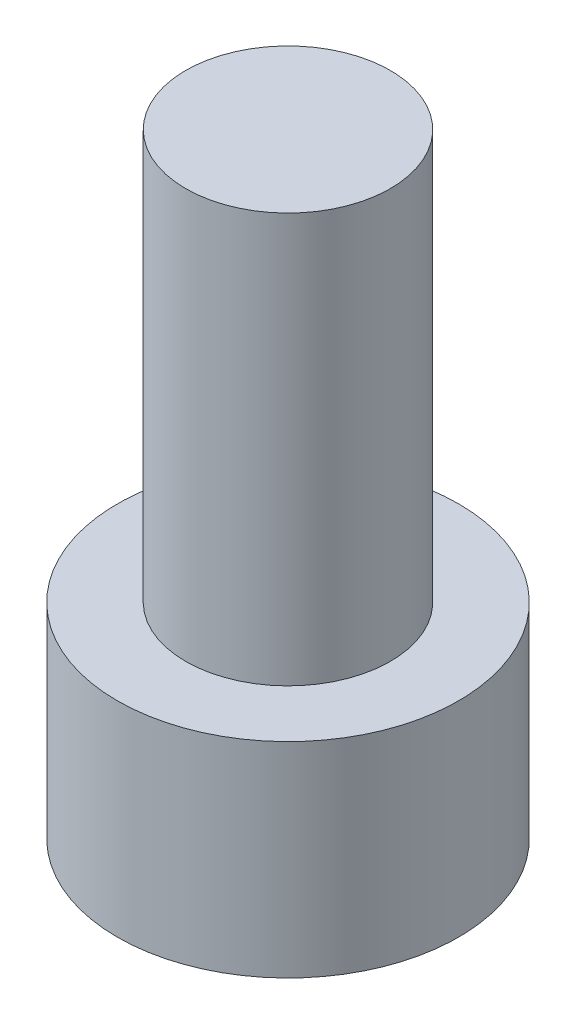
ISO-10303-21;
HEADER;
FILE_DESCRIPTION(('STEP AP214'),'2;1');
FILE_NAME('part.step','',(''),(''),'','','');
FILE_SCHEMA(('AUTOMOTIVE_DESIGN { 1 0 10303 214 1 1 1 1 }'));
ENDSEC;
DATA;
#1=APPLICATION_CONTEXT('core data for automotive mechanical design processes');
#2=APPLICATION_PROTOCOL_DEFINITION('international standard','automotive_design',2000,#1);
#3=PRODUCT_CONTEXT('',#1,'mechanical');
#4=PRODUCT('Part','Part','',(#3));
#5=PRODUCT_RELATED_PRODUCT_CATEGORY('part','',(#4));
#6=PRODUCT_DEFINITION_FORMATION('','',#4);
#7=PRODUCT_DEFINITION_CONTEXT('part definition',#1,'design');
#8=PRODUCT_DEFINITION('design','',#6,#7);
#9=PRODUCT_DEFINITION_SHAPE('','',#8);
#10=(LENGTH_UNIT() NAMED_UNIT(*) SI_UNIT(.MILLI.,.METRE.));
#11=(NAMED_UNIT(*) PLANE_ANGLE_UNIT() SI_UNIT($,.RADIAN.));
#12=(NAMED_UNIT(*) SI_UNIT($,.STERADIAN.) SOLID_ANGLE_UNIT());
#13=UNCERTAINTY_MEASURE_WITH_UNIT(LENGTH_MEASURE(1.E-05),#10,'distance_accuracy_value','');
#14=(GEOMETRIC_REPRESENTATION_CONTEXT(3) GLOBAL_UNCERTAINTY_ASSIGNED_CONTEXT((#13)) GLOBAL_UNIT_ASSIGNED_CONTEXT((#10,
#11,#12)) REPRESENTATION_CONTEXT('',''));
#15=CARTESIAN_POINT('',(0.,0.,0.));
#16=DIRECTION('',(0.,0.,1.));
#17=DIRECTION('',(1.,0.,0.));
#18=AXIS2_PLACEMENT_3D('',#15,#16,#17);
#19=CARTESIAN_POINT('',(0.,3.,0.));
#20=DIRECTION('',(0.,-1.,0.));
#21=DIRECTION('',(0.,0.,-1.));
#22=AXIS2_PLACEMENT_3D('',#19,#20,#21);
#23=CYLINDRICAL_SURFACE('',#22,2.5);
#24=CARTESIAN_POINT('',(0.,3.,0.));
#25=DIRECTION('',(0.,1.,0.));
#26=DIRECTION('',(0.,0.,1.));
#27=AXIS2_PLACEMENT_3D('',#24,#25,#26);
#28=CIRCLE('',#27,2.5);
#29=CARTESIAN_POINT('',(0.,3.,2.5));
#30=VERTEX_POINT('',#29);
#31=EDGE_CURVE('E10',#30,#30,#28,.T.);
#32=ORIENTED_EDGE('',*,*,#31,.F.);
#33=EDGE_LOOP('',(#32));
#34=FACE_BOUND('',#33,.T.);
#35=CARTESIAN_POINT('',(0.,0.,0.));
#36=DIRECTION('',(0.,1.,0.));
#37=DIRECTION('',(0.,0.,1.));
#38=AXIS2_PLACEMENT_3D('',#35,#36,#37);
#39=CIRCLE('',#38,2.5);
#40=CARTESIAN_POINT('',(0.,0.,2.5));
#41=VERTEX_POINT('',#40);
#42=EDGE_CURVE('E37',#41,#41,#39,.T.);
#43=ORIENTED_EDGE('',*,*,#42,.T.);
#44=EDGE_LOOP('',(#43));
#45=FACE_BOUND('',#44,.T.);
#46=ADVANCED_FACE('F40',(#34,#45),#23,.T.);
#47=CARTESIAN_POINT('',(0.,3.,0.));
#48=DIRECTION('',(0.,1.,0.));
#49=DIRECTION('',(0.,0.,1.));
#50=AXIS2_PLACEMENT_3D('',#47,#48,#49);
#51=PLANE('',#50);
#52=CARTESIAN_POINT('',(0.,3.,0.));
#53=DIRECTION('',(0.,1.,0.));
#54=DIRECTION('',(0.,0.,1.));
#55=AXIS2_PLACEMENT_3D('',#52,#53,#54);
#56=CIRCLE('',#55,1.5);
#57=CARTESIAN_POINT('',(0.,3.,1.5));
#58=VERTEX_POINT('',#57);
#59=EDGE_CURVE('E50',#58,#58,#56,.F.);
#60=ORIENTED_EDGE('',*,*,#59,.T.);
#61=EDGE_LOOP('',(#60));
#62=FACE_BOUND('',#61,.T.);
#63=ORIENTED_EDGE('',*,*,#31,.T.);
#64=EDGE_LOOP('',(#63));
#65=FACE_BOUND('',#64,.T.);
#66=ADVANCED_FACE('F70',(#62,#65),#51,.T.);
#67=CARTESIAN_POINT('',(0.,0.,0.));
#68=DIRECTION('',(0.,1.,0.));
#69=DIRECTION('',(0.,0.,1.));
#70=AXIS2_PLACEMENT_3D('',#67,#68,#69);
#71=PLANE('',#70);
#72=ORIENTED_EDGE('',*,*,#42,.F.);
#73=EDGE_LOOP('',(#72));
#74=FACE_BOUND('',#73,.T.);
#75=ADVANCED_FACE('F56',(#74),#71,.F.);
#76=CARTESIAN_POINT('',(0.,9.,0.));
#77=DIRECTION('',(0.,-1.,0.));
#78=DIRECTION('',(0.,0.,-1.));
#79=AXIS2_PLACEMENT_3D('',#76,#77,#78);
#80=CYLINDRICAL_SURFACE('',#79,1.5);
#81=ORIENTED_EDGE('',*,*,#59,.F.);
#82=EDGE_LOOP('',(#81));
#83=FACE_BOUND('',#82,.T.);
#84=CARTESIAN_POINT('',(0.,9.,0.));
#85=DIRECTION('',(0.,1.,0.));
#86=DIRECTION('',(0.,0.,1.));
#87=AXIS2_PLACEMENT_3D('',#84,#85,#86);
#88=CIRCLE('',#87,1.5);
#89=CARTESIAN_POINT('',(0.,9.,1.5));
#90=VERTEX_POINT('',#89);
#91=EDGE_CURVE('E51',#90,#90,#88,.T.);
#92=ORIENTED_EDGE('',*,*,#91,.F.);
#93=EDGE_LOOP('',(#92));
#94=FACE_BOUND('',#93,.T.);
#95=ADVANCED_FACE('F60',(#83,#94),#80,.T.);
#96=CARTESIAN_POINT('',(0.,9.,0.));
#97=DIRECTION('',(0.,1.,0.));
#98=DIRECTION('',(0.,0.,1.));
#99=AXIS2_PLACEMENT_3D('',#96,#97,#98);
#100=PLANE('',#99);
#101=ORIENTED_EDGE('',*,*,#91,.T.);
#102=EDGE_LOOP('',(#101));
#103=FACE_BOUND('',#102,.T.);
#104=ADVANCED_FACE('F54',(#103),#100,.T.);
#105=CLOSED_SHELL('',(#46,#66,#75,#95,#104));
#106=MANIFOLD_SOLID_BREP('B2',#105);
#107=ADVANCED_BREP_SHAPE_REPRESENTATION('',(#18,#106),#14);
#108=SHAPE_DEFINITION_REPRESENTATION(#9,#107);
ENDSEC;
END-ISO-10303-21;
